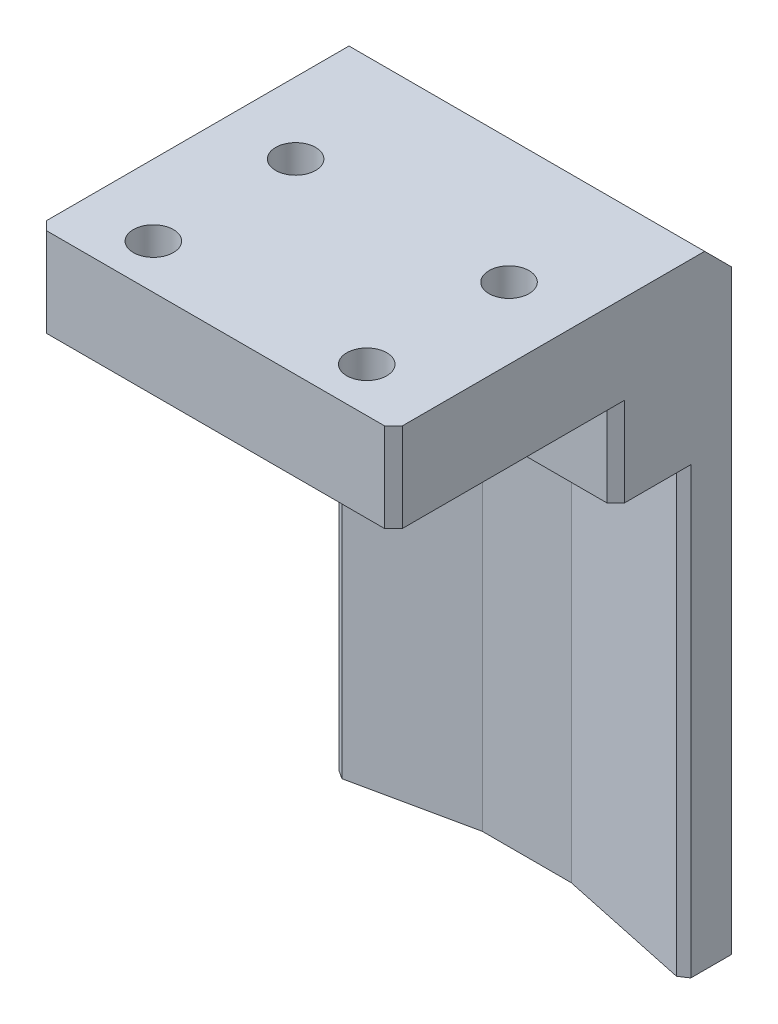
ISO-10303-21;
HEADER;
FILE_DESCRIPTION(('STEP AP214'),'2;1');
FILE_NAME('part.step','',(''),(''),'','','');
FILE_SCHEMA(('AUTOMOTIVE_DESIGN { 1 0 10303 214 1 1 1 1 }'));
ENDSEC;
DATA;
#1=APPLICATION_CONTEXT('core data for automotive mechanical design processes');
#2=APPLICATION_PROTOCOL_DEFINITION('international standard','automotive_design',2000,#1);
#3=PRODUCT_CONTEXT('',#1,'mechanical');
#4=PRODUCT('Part','Part','',(#3));
#5=PRODUCT_RELATED_PRODUCT_CATEGORY('part','',(#4));
#6=PRODUCT_DEFINITION_FORMATION('','',#4);
#7=PRODUCT_DEFINITION_CONTEXT('part definition',#1,'design');
#8=PRODUCT_DEFINITION('design','',#6,#7);
#9=PRODUCT_DEFINITION_SHAPE('','',#8);
#10=(LENGTH_UNIT() NAMED_UNIT(*) SI_UNIT(.MILLI.,.METRE.));
#11=(NAMED_UNIT(*) PLANE_ANGLE_UNIT() SI_UNIT($,.RADIAN.));
#12=(NAMED_UNIT(*) SI_UNIT($,.STERADIAN.) SOLID_ANGLE_UNIT());
#13=UNCERTAINTY_MEASURE_WITH_UNIT(LENGTH_MEASURE(1.E-05),#10,'distance_accuracy_value','');
#14=(GEOMETRIC_REPRESENTATION_CONTEXT(3) GLOBAL_UNCERTAINTY_ASSIGNED_CONTEXT((#13)) GLOBAL_UNIT_ASSIGNED_CONTEXT((#10,
#11,#12)) REPRESENTATION_CONTEXT('',''));
#15=CARTESIAN_POINT('',(0.,0.,0.));
#16=DIRECTION('',(0.,0.,1.));
#17=DIRECTION('',(1.,0.,0.));
#18=AXIS2_PLACEMENT_3D('',#15,#16,#17);
#19=CARTESIAN_POINT('',(-20.,60.,7.5));
#20=DIRECTION('',(0.,0.,-1.));
#21=DIRECTION('',(-1.,0.,0.));
#22=AXIS2_PLACEMENT_3D('',#19,#20,#21);
#23=PLANE('',#22);
#24=DIRECTION('',(1.,0.,0.));
#25=VECTOR('',#24,1.);
#26=CARTESIAN_POINT('',(-20.,60.,7.5));
#27=LINE('',#26,#25);
#28=CARTESIAN_POINT('',(-19.,60.,7.5));
#29=VERTEX_POINT('',#28);
#30=CARTESIAN_POINT('',(-12.,60.,7.5));
#31=VERTEX_POINT('',#30);
#32=EDGE_CURVE('E334',#29,#31,#27,.T.);
#33=ORIENTED_EDGE('',*,*,#32,.F.);
#34=DIRECTION('',(0.,-1.,0.));
#35=VECTOR('',#34,1.);
#36=CARTESIAN_POINT('',(-19.,60.,7.5));
#37=LINE('',#36,#35);
#38=CARTESIAN_POINT('',(-19.,50.,7.5));
#39=VERTEX_POINT('',#38);
#40=EDGE_CURVE('E429',#29,#39,#37,.T.);
#41=ORIENTED_EDGE('',*,*,#40,.T.);
#42=DIRECTION('',(1.,0.,0.));
#43=VECTOR('',#42,1.);
#44=CARTESIAN_POINT('',(-20.,50.,7.5));
#45=LINE('',#44,#43);
#46=CARTESIAN_POINT('',(-9.99999999999995,50.,7.5));
#47=VERTEX_POINT('',#46);
#48=EDGE_CURVE('E380',#39,#47,#45,.T.);
#49=ORIENTED_EDGE('',*,*,#48,.T.);
#50=DIRECTION('',(0.,-1.,0.));
#51=VECTOR('',#50,1.);
#52=CARTESIAN_POINT('',(-9.99999999999995,80.6155281280883,7.5));
#53=LINE('',#52,#51);
#54=CARTESIAN_POINT('',(-9.99999999999995,60.,7.5));
#55=VERTEX_POINT('',#54);
#56=EDGE_CURVE('E235',#55,#47,#53,.T.);
#57=ORIENTED_EDGE('',*,*,#56,.F.);
#58=EDGE_CURVE('E222',#31,#55,#27,.T.);
#59=ORIENTED_EDGE('',*,*,#58,.F.);
#60=EDGE_LOOP('',(#33,#41,#49,#57,#59));
#61=FACE_BOUND('',#60,.T.);
#62=ADVANCED_FACE('F34',(#61),#23,.F.);
#63=CARTESIAN_POINT('',(0.,60.,0.));
#64=DIRECTION('',(0.,1.,0.));
#65=DIRECTION('',(0.,0.,1.));
#66=AXIS2_PLACEMENT_3D('',#63,#64,#65);
#67=PLANE('',#66);
#68=CARTESIAN_POINT('',(12.,60.,27.5));
#69=DIRECTION('',(0.,-1.,0.));
#70=DIRECTION('',(0.,0.,-1.));
#71=AXIS2_PLACEMENT_3D('',#68,#69,#70);
#72=CIRCLE('',#71,4.);
#73=CARTESIAN_POINT('',(12.,60.,23.5));
#74=VERTEX_POINT('',#73);
#75=EDGE_CURVE('E297',#74,#74,#72,.T.);
#76=ORIENTED_EDGE('',*,*,#75,.F.);
#77=EDGE_LOOP('',(#76));
#78=FACE_BOUND('',#77,.T.);
#79=CARTESIAN_POINT('',(-12.,60.,27.5));
#80=DIRECTION('',(0.,-1.,0.));
#81=DIRECTION('',(0.,0.,-1.));
#82=AXIS2_PLACEMENT_3D('',#79,#80,#81);
#83=CIRCLE('',#82,4.);
#84=CARTESIAN_POINT('',(-12.,60.,23.5));
#85=VERTEX_POINT('',#84);
#86=EDGE_CURVE('E285',#85,#85,#83,.T.);
#87=ORIENTED_EDGE('',*,*,#86,.F.);
#88=EDGE_LOOP('',(#87));
#89=FACE_BOUND('',#88,.T.);
#90=DIRECTION('',(1.,0.,0.));
#91=VECTOR('',#90,1.);
#92=CARTESIAN_POINT('',(-20.,60.,32.5));
#93=LINE('',#92,#91);
#94=CARTESIAN_POINT('',(-19.,60.,32.5));
#95=VERTEX_POINT('',#94);
#96=CARTESIAN_POINT('',(19.,60.,32.5));
#97=VERTEX_POINT('',#96);
#98=EDGE_CURVE('E322',#95,#97,#93,.T.);
#99=ORIENTED_EDGE('',*,*,#98,.F.);
#100=DIRECTION('',(0.707106781186548,0.,0.707106781186548));
#101=VECTOR('',#100,1.);
#102=CARTESIAN_POINT('',(-19.,60.,32.5));
#103=LINE('',#102,#101);
#104=CARTESIAN_POINT('',(-20.,60.,31.5));
#105=VERTEX_POINT('',#104);
#106=EDGE_CURVE('E409',#95,#105,#103,.F.);
#107=ORIENTED_EDGE('',*,*,#106,.T.);
#108=DIRECTION('',(0.,0.,1.));
#109=VECTOR('',#108,1.);
#110=CARTESIAN_POINT('',(-20.,60.,-7.5));
#111=LINE('',#110,#109);
#112=CARTESIAN_POINT('',(-20.,60.,6.49999999999998));
#113=VERTEX_POINT('',#112);
#114=EDGE_CURVE('E309',#113,#105,#111,.T.);
#115=ORIENTED_EDGE('',*,*,#114,.F.);
#116=DIRECTION('',(-0.707106781186548,0.,-0.707106781186548));
#117=VECTOR('',#116,1.);
#118=CARTESIAN_POINT('',(-13.25,60.,13.25));
#119=LINE('',#118,#117);
#120=EDGE_CURVE('E42',#113,#29,#119,.F.);
#121=ORIENTED_EDGE('',*,*,#120,.T.);
#122=ORIENTED_EDGE('',*,*,#32,.T.);
#123=CARTESIAN_POINT('',(-12.,60.,11.5));
#124=DIRECTION('',(0.,-1.,0.));
#125=DIRECTION('',(0.,0.,-1.));
#126=AXIS2_PLACEMENT_3D('',#123,#124,#125);
#127=CIRCLE('',#126,4.);
#128=EDGE_CURVE('E261',#31,#31,#127,.T.);
#129=ORIENTED_EDGE('',*,*,#128,.F.);
#130=ORIENTED_EDGE('',*,*,#58,.T.);
#131=DIRECTION('',(0.707106781186544,0.,-0.707106781186551));
#132=VECTOR('',#131,1.);
#133=CARTESIAN_POINT('',(-9.99999999999995,60.,7.5));
#134=LINE('',#133,#132);
#135=CARTESIAN_POINT('',(-5.,60.,2.5));
#136=VERTEX_POINT('',#135);
#137=EDGE_CURVE('E211',#55,#136,#134,.T.);
#138=ORIENTED_EDGE('',*,*,#137,.T.);
#139=DIRECTION('',(1.,0.,0.));
#140=VECTOR('',#139,1.);
#141=CARTESIAN_POINT('',(-5.,60.,2.5));
#142=LINE('',#141,#140);
#143=CARTESIAN_POINT('',(5.,60.,2.5));
#144=VERTEX_POINT('',#143);
#145=EDGE_CURVE('E197',#136,#144,#142,.T.);
#146=ORIENTED_EDGE('',*,*,#145,.T.);
#147=DIRECTION('',(0.707106781186551,0.,0.707106781186544));
#148=VECTOR('',#147,1.);
#149=CARTESIAN_POINT('',(5.,60.,2.5));
#150=LINE('',#149,#148);
#151=CARTESIAN_POINT('',(10.0000000000001,60.,7.5));
#152=VERTEX_POINT('',#151);
#153=EDGE_CURVE('E230',#144,#152,#150,.T.);
#154=ORIENTED_EDGE('',*,*,#153,.T.);
#155=CARTESIAN_POINT('',(12.,60.,7.5));
#156=VERTEX_POINT('',#155);
#157=EDGE_CURVE('E344',#152,#156,#27,.T.);
#158=ORIENTED_EDGE('',*,*,#157,.T.);
#159=CARTESIAN_POINT('',(12.,60.,11.5));
#160=DIRECTION('',(0.,-1.,0.));
#161=DIRECTION('',(0.,0.,-1.));
#162=AXIS2_PLACEMENT_3D('',#159,#160,#161);
#163=CIRCLE('',#162,4.);
#164=EDGE_CURVE('E271',#156,#156,#163,.T.);
#165=ORIENTED_EDGE('',*,*,#164,.F.);
#166=CARTESIAN_POINT('',(19.,60.,7.5));
#167=VERTEX_POINT('',#166);
#168=EDGE_CURVE('E340',#156,#167,#27,.T.);
#169=ORIENTED_EDGE('',*,*,#168,.T.);
#170=DIRECTION('',(-0.707106781186554,0.,0.707106781186541));
#171=VECTOR('',#170,1.);
#172=CARTESIAN_POINT('',(13.2499999999998,60.,13.2500000000001));
#173=LINE('',#172,#171);
#174=CARTESIAN_POINT('',(20.,60.,6.5));
#175=VERTEX_POINT('',#174);
#176=EDGE_CURVE('E11',#167,#175,#173,.F.);
#177=ORIENTED_EDGE('',*,*,#176,.T.);
#178=DIRECTION('',(0.,0.,-1.));
#179=VECTOR('',#178,1.);
#180=CARTESIAN_POINT('',(20.,60.,-7.5));
#181=LINE('',#180,#179);
#182=CARTESIAN_POINT('',(20.,60.,31.5));
#183=VERTEX_POINT('',#182);
#184=EDGE_CURVE('E314',#183,#175,#181,.T.);
#185=ORIENTED_EDGE('',*,*,#184,.F.);
#186=DIRECTION('',(0.707106781186555,0.,-0.70710678118654));
#187=VECTOR('',#186,1.);
#188=CARTESIAN_POINT('',(20.,60.,31.5));
#189=LINE('',#188,#187);
#190=EDGE_CURVE('E404',#183,#97,#189,.F.);
#191=ORIENTED_EDGE('',*,*,#190,.T.);
#192=EDGE_LOOP('',(#99,#107,#115,#121,#122,#129,#130,#138,#146,#154,#158,#165,#169,#177,#185,#191));
#193=FACE_BOUND('',#192,.T.);
#194=ADVANCED_FACE('F219',(#78,#89,#193),#67,.F.);
#195=CARTESIAN_POINT('',(20.,60.,-7.5));
#196=DIRECTION('',(-1.,0.,0.));
#197=DIRECTION('',(0.,0.,1.));
#198=AXIS2_PLACEMENT_3D('',#195,#196,#197);
#199=PLANE('',#198);
#200=DIRECTION('',(0.,0.,-1.));
#201=VECTOR('',#200,1.);
#202=CARTESIAN_POINT('',(20.,70.,-7.5));
#203=LINE('',#202,#201);
#204=CARTESIAN_POINT('',(20.,70.,31.5));
#205=VERTEX_POINT('',#204);
#206=CARTESIAN_POINT('',(20.,70.,-2.50000000000001));
#207=VERTEX_POINT('',#206);
#208=EDGE_CURVE('E317',#205,#207,#203,.T.);
#209=ORIENTED_EDGE('',*,*,#208,.F.);
#210=DIRECTION('',(0.,-1.,0.));
#211=VECTOR('',#210,1.);
#212=CARTESIAN_POINT('',(20.,60.,31.5));
#213=LINE('',#212,#211);
#214=EDGE_CURVE('E426',#205,#183,#213,.T.);
#215=ORIENTED_EDGE('',*,*,#214,.T.);
#216=ORIENTED_EDGE('',*,*,#184,.T.);
#217=DIRECTION('',(0.,-1.,0.));
#218=VECTOR('',#217,1.);
#219=CARTESIAN_POINT('',(20.,60.,6.5));
#220=LINE('',#219,#218);
#221=CARTESIAN_POINT('',(20.,50.,6.5));
#222=VERTEX_POINT('',#221);
#223=EDGE_CURVE('E423',#175,#222,#220,.T.);
#224=ORIENTED_EDGE('',*,*,#223,.T.);
#225=DIRECTION('',(0.,0.,-1.));
#226=VECTOR('',#225,1.);
#227=CARTESIAN_POINT('',(20.,50.,-7.5));
#228=LINE('',#227,#226);
#229=CARTESIAN_POINT('',(20.,50.,-0.942223183281844));
#230=VERTEX_POINT('',#229);
#231=EDGE_CURVE('E259',#222,#230,#228,.T.);
#232=ORIENTED_EDGE('',*,*,#231,.T.);
#233=DIRECTION('',(0.,-1.,0.));
#234=VECTOR('',#233,1.);
#235=CARTESIAN_POINT('',(20.,60.,-0.942223183281844));
#236=LINE('',#235,#234);
#237=CARTESIAN_POINT('',(20.,0.,-0.942223183281845));
#238=VERTEX_POINT('',#237);
#239=EDGE_CURVE('E391',#230,#238,#236,.T.);
#240=ORIENTED_EDGE('',*,*,#239,.T.);
#241=DIRECTION('',(0.,0.,-1.));
#242=VECTOR('',#241,1.);
#243=CARTESIAN_POINT('',(20.,0.,-7.5));
#244=LINE('',#243,#242);
#245=CARTESIAN_POINT('',(20.,0.,-5.5));
#246=VERTEX_POINT('',#245);
#247=EDGE_CURVE('E319',#238,#246,#244,.T.);
#248=ORIENTED_EDGE('',*,*,#247,.T.);
#249=DIRECTION('',(0.,1.,0.));
#250=VECTOR('',#249,1.);
#251=CARTESIAN_POINT('',(20.,60.,-5.5));
#252=LINE('',#251,#250);
#253=CARTESIAN_POINT('',(20.,67.,-5.5));
#254=VERTEX_POINT('',#253);
#255=EDGE_CURVE('E367',#246,#254,#252,.T.);
#256=ORIENTED_EDGE('',*,*,#255,.T.);
#257=DIRECTION('',(0.,0.707106781186549,0.707106781186547));
#258=VECTOR('',#257,1.);
#259=CARTESIAN_POINT('',(20.,70.,-2.50000000000001));
#260=LINE('',#259,#258);
#261=EDGE_CURVE('E354',#254,#207,#260,.T.);
#262=ORIENTED_EDGE('',*,*,#261,.T.);
#263=EDGE_LOOP('',(#209,#215,#216,#224,#232,#240,#248,#256,#262));
#264=FACE_BOUND('',#263,.T.);
#265=ADVANCED_FACE('F455',(#264),#199,.F.);
#266=CARTESIAN_POINT('',(-20.,60.,-7.5));
#267=DIRECTION('',(0.,0.,1.));
#268=DIRECTION('',(1.,0.,0.));
#269=AXIS2_PLACEMENT_3D('',#266,#267,#268);
#270=PLANE('',#269);
#271=DIRECTION('',(1.,0.,0.));
#272=VECTOR('',#271,1.);
#273=CARTESIAN_POINT('',(20.,65.,-7.5));
#274=LINE('',#273,#272);
#275=CARTESIAN_POINT('',(-18.,65.,-7.5));
#276=VERTEX_POINT('',#275);
#277=CARTESIAN_POINT('',(18.,65.,-7.5));
#278=VERTEX_POINT('',#277);
#279=EDGE_CURVE('E351',#276,#278,#274,.T.);
#280=ORIENTED_EDGE('',*,*,#279,.T.);
#281=DIRECTION('',(0.,-1.,0.));
#282=VECTOR('',#281,1.);
#283=CARTESIAN_POINT('',(18.,60.,-7.5));
#284=LINE('',#283,#282);
#285=CARTESIAN_POINT('',(18.,0.,-7.5));
#286=VERTEX_POINT('',#285);
#287=EDGE_CURVE('E359',#278,#286,#284,.T.);
#288=ORIENTED_EDGE('',*,*,#287,.T.);
#289=DIRECTION('',(-1.,0.,0.));
#290=VECTOR('',#289,1.);
#291=CARTESIAN_POINT('',(-20.,0.,-7.5));
#292=LINE('',#291,#290);
#293=CARTESIAN_POINT('',(-18.,0.,-7.5));
#294=VERTEX_POINT('',#293);
#295=EDGE_CURVE('E482',#286,#294,#292,.T.);
#296=ORIENTED_EDGE('',*,*,#295,.T.);
#297=DIRECTION('',(0.,1.,0.));
#298=VECTOR('',#297,1.);
#299=CARTESIAN_POINT('',(-18.,60.,-7.5));
#300=LINE('',#299,#298);
#301=EDGE_CURVE('E357',#294,#276,#300,.T.);
#302=ORIENTED_EDGE('',*,*,#301,.T.);
#303=EDGE_LOOP('',(#280,#288,#296,#302));
#304=FACE_BOUND('',#303,.T.);
#305=ADVANCED_FACE('F470',(#304),#270,.F.);
#306=CARTESIAN_POINT('',(-20.,60.,-7.5));
#307=DIRECTION('',(1.,0.,0.));
#308=DIRECTION('',(0.,0.,-1.));
#309=AXIS2_PLACEMENT_3D('',#306,#307,#308);
#310=PLANE('',#309);
#311=ORIENTED_EDGE('',*,*,#114,.T.);
#312=DIRECTION('',(0.,1.,0.));
#313=VECTOR('',#312,1.);
#314=CARTESIAN_POINT('',(-20.,60.,31.5));
#315=LINE('',#314,#313);
#316=CARTESIAN_POINT('',(-20.,70.,31.5));
#317=VERTEX_POINT('',#316);
#318=EDGE_CURVE('E417',#105,#317,#315,.T.);
#319=ORIENTED_EDGE('',*,*,#318,.T.);
#320=DIRECTION('',(0.,0.,1.));
#321=VECTOR('',#320,1.);
#322=CARTESIAN_POINT('',(-20.,70.,-7.5));
#323=LINE('',#322,#321);
#324=CARTESIAN_POINT('',(-20.,70.,-2.5));
#325=VERTEX_POINT('',#324);
#326=EDGE_CURVE('E310',#325,#317,#323,.T.);
#327=ORIENTED_EDGE('',*,*,#326,.F.);
#328=DIRECTION('',(0.,-0.707106781186549,-0.707106781186547));
#329=VECTOR('',#328,1.);
#330=CARTESIAN_POINT('',(-20.,70.,-2.5));
#331=LINE('',#330,#329);
#332=CARTESIAN_POINT('',(-20.,67.,-5.50000000000001));
#333=VERTEX_POINT('',#332);
#334=EDGE_CURVE('E348',#325,#333,#331,.T.);
#335=ORIENTED_EDGE('',*,*,#334,.T.);
#336=DIRECTION('',(0.,-1.,0.));
#337=VECTOR('',#336,1.);
#338=CARTESIAN_POINT('',(-20.,60.,-5.5));
#339=LINE('',#338,#337);
#340=CARTESIAN_POINT('',(-20.,0.,-5.5));
#341=VERTEX_POINT('',#340);
#342=EDGE_CURVE('E373',#333,#341,#339,.T.);
#343=ORIENTED_EDGE('',*,*,#342,.T.);
#344=DIRECTION('',(0.,0.,1.));
#345=VECTOR('',#344,1.);
#346=CARTESIAN_POINT('',(-20.,0.,-7.5));
#347=LINE('',#346,#345);
#348=CARTESIAN_POINT('',(-20.,0.,-1.36733630662202));
#349=VERTEX_POINT('',#348);
#350=EDGE_CURVE('E480',#341,#349,#347,.T.);
#351=ORIENTED_EDGE('',*,*,#350,.T.);
#352=DIRECTION('',(0.,1.,0.));
#353=VECTOR('',#352,1.);
#354=CARTESIAN_POINT('',(-20.,60.,-1.36733630662202));
#355=LINE('',#354,#353);
#356=CARTESIAN_POINT('',(-20.,50.,-1.36733630662202));
#357=VERTEX_POINT('',#356);
#358=EDGE_CURVE('E382',#349,#357,#355,.T.);
#359=ORIENTED_EDGE('',*,*,#358,.T.);
#360=DIRECTION('',(0.,0.,1.));
#361=VECTOR('',#360,1.);
#362=CARTESIAN_POINT('',(-20.,50.,-7.5));
#363=LINE('',#362,#361);
#364=CARTESIAN_POINT('',(-20.,50.,6.49999999999998));
#365=VERTEX_POINT('',#364);
#366=EDGE_CURVE('E255',#357,#365,#363,.T.);
#367=ORIENTED_EDGE('',*,*,#366,.T.);
#368=DIRECTION('',(0.,1.,0.));
#369=VECTOR('',#368,1.);
#370=CARTESIAN_POINT('',(-20.,60.,6.49999999999998));
#371=LINE('',#370,#369);
#372=EDGE_CURVE('E412',#365,#113,#371,.T.);
#373=ORIENTED_EDGE('',*,*,#372,.T.);
#374=EDGE_LOOP('',(#311,#319,#327,#335,#343,#351,#359,#367,#373));
#375=FACE_BOUND('',#374,.T.);
#376=ADVANCED_FACE('F462',(#375),#310,.F.);
#377=CARTESIAN_POINT('',(10.0000000000001,50.,7.5));
#378=VERTEX_POINT('',#377);
#379=CARTESIAN_POINT('',(19.,50.,7.5));
#380=VERTEX_POINT('',#379);
#381=EDGE_CURVE('E379',#378,#380,#45,.T.);
#382=ORIENTED_EDGE('',*,*,#381,.T.);
#383=DIRECTION('',(0.,1.,0.));
#384=VECTOR('',#383,1.);
#385=CARTESIAN_POINT('',(19.,60.,7.5));
#386=LINE('',#385,#384);
#387=EDGE_CURVE('E433',#380,#167,#386,.T.);
#388=ORIENTED_EDGE('',*,*,#387,.T.);
#389=ORIENTED_EDGE('',*,*,#168,.F.);
#390=ORIENTED_EDGE('',*,*,#157,.F.);
#391=DIRECTION('',(0.,-1.,0.));
#392=VECTOR('',#391,1.);
#393=CARTESIAN_POINT('',(10.0000000000001,80.6155281280883,7.5));
#394=LINE('',#393,#392);
#395=EDGE_CURVE('E231',#152,#378,#394,.T.);
#396=ORIENTED_EDGE('',*,*,#395,.T.);
#397=EDGE_LOOP('',(#382,#388,#389,#390,#396));
#398=FACE_BOUND('',#397,.T.);
#399=ADVANCED_FACE('F451',(#398),#23,.F.);
#400=CARTESIAN_POINT('',(0.,0.,0.));
#401=DIRECTION('',(0.,1.,0.));
#402=DIRECTION('',(0.,0.,1.));
#403=AXIS2_PLACEMENT_3D('',#400,#401,#402);
#404=PLANE('',#403);
#405=DIRECTION('',(-0.978147600733807,0.,0.207911690817752));
#406=VECTOR('',#405,1.);
#407=CARTESIAN_POINT('',(-0.971152752454807,0.,-4.56891448010192));
#408=LINE('',#407,#406);
#409=CARTESIAN_POINT('',(-6.,0.,-3.5));
#410=VERTEX_POINT('',#409);
#411=CARTESIAN_POINT('',(-19.0218523992662,0.,-0.732119827437547));
#412=VERTEX_POINT('',#411);
#413=EDGE_CURVE('E376',#410,#412,#408,.T.);
#414=ORIENTED_EDGE('',*,*,#413,.T.);
#415=DIRECTION('',(0.838670567945421,0.,0.544639035015032));
#416=VECTOR('',#415,1.);
#417=CARTESIAN_POINT('',(-20.,0.,-1.36733630662202));
#418=LINE('',#417,#416);
#419=EDGE_CURVE('E389',#412,#349,#418,.F.);
#420=ORIENTED_EDGE('',*,*,#419,.T.);
#421=ORIENTED_EDGE('',*,*,#350,.F.);
#422=DIRECTION('',(-0.707106781186548,0.,0.707106781186548));
#423=VECTOR('',#422,1.);
#424=CARTESIAN_POINT('',(-20.,0.,-5.5));
#425=LINE('',#424,#423);
#426=EDGE_CURVE('E362',#341,#294,#425,.F.);
#427=ORIENTED_EDGE('',*,*,#426,.T.);
#428=ORIENTED_EDGE('',*,*,#295,.F.);
#429=DIRECTION('',(-0.707106781186548,0.,-0.707106781186548));
#430=VECTOR('',#429,1.);
#431=CARTESIAN_POINT('',(18.,0.,-7.5));
#432=LINE('',#431,#430);
#433=EDGE_CURVE('E364',#286,#246,#432,.F.);
#434=ORIENTED_EDGE('',*,*,#433,.T.);
#435=ORIENTED_EDGE('',*,*,#247,.F.);
#436=DIRECTION('',(0.838670567945425,0.,-0.544639035015025));
#437=VECTOR('',#436,1.);
#438=CARTESIAN_POINT('',(20.,0.,-0.942223183281844));
#439=LINE('',#438,#437);
#440=CARTESIAN_POINT('',(19.0218523992662,0.,-0.307006704097394));
#441=VERTEX_POINT('',#440);
#442=EDGE_CURVE('E387',#238,#441,#439,.F.);
#443=ORIENTED_EDGE('',*,*,#442,.T.);
#444=DIRECTION('',(0.978147600733806,0.,0.20791169081776));
#445=VECTOR('',#444,1.);
#446=CARTESIAN_POINT('',(4.,0.,-3.5));
#447=LINE('',#446,#445);
#448=CARTESIAN_POINT('',(4.,0.,-3.5));
#449=VERTEX_POINT('',#448);
#450=EDGE_CURVE('E242',#449,#441,#447,.T.);
#451=ORIENTED_EDGE('',*,*,#450,.F.);
#452=DIRECTION('',(1.,0.,0.));
#453=VECTOR('',#452,1.);
#454=CARTESIAN_POINT('',(-6.,0.,-3.5));
#455=LINE('',#454,#453);
#456=EDGE_CURVE('E238',#410,#449,#455,.T.);
#457=ORIENTED_EDGE('',*,*,#456,.F.);
#458=EDGE_LOOP('',(#414,#420,#421,#427,#428,#434,#435,#443,#451,#457));
#459=FACE_BOUND('',#458,.T.);
#460=ADVANCED_FACE('F461',(#459),#404,.F.);
#461=CARTESIAN_POINT('',(-20.,70.,32.5));
#462=DIRECTION('',(0.,0.,-1.));
#463=DIRECTION('',(-1.,0.,0.));
#464=AXIS2_PLACEMENT_3D('',#461,#462,#463);
#465=PLANE('',#464);
#466=DIRECTION('',(1.,0.,0.));
#467=VECTOR('',#466,1.);
#468=CARTESIAN_POINT('',(-20.,70.,32.5));
#469=LINE('',#468,#467);
#470=CARTESIAN_POINT('',(-19.,70.,32.5));
#471=VERTEX_POINT('',#470);
#472=CARTESIAN_POINT('',(19.,70.,32.5));
#473=VERTEX_POINT('',#472);
#474=EDGE_CURVE('E313',#471,#473,#469,.T.);
#475=ORIENTED_EDGE('',*,*,#474,.F.);
#476=DIRECTION('',(0.,-1.,0.));
#477=VECTOR('',#476,1.);
#478=CARTESIAN_POINT('',(-19.,70.,32.5));
#479=LINE('',#478,#477);
#480=EDGE_CURVE('E402',#471,#95,#479,.T.);
#481=ORIENTED_EDGE('',*,*,#480,.T.);
#482=ORIENTED_EDGE('',*,*,#98,.T.);
#483=DIRECTION('',(0.,1.,0.));
#484=VECTOR('',#483,1.);
#485=CARTESIAN_POINT('',(19.,70.,32.5));
#486=LINE('',#485,#484);
#487=EDGE_CURVE('E400',#97,#473,#486,.T.);
#488=ORIENTED_EDGE('',*,*,#487,.T.);
#489=EDGE_LOOP('',(#475,#481,#482,#488));
#490=FACE_BOUND('',#489,.T.);
#491=ADVANCED_FACE('F468',(#490),#465,.F.);
#492=CARTESIAN_POINT('',(0.,70.,0.));
#493=DIRECTION('',(0.,1.,0.));
#494=DIRECTION('',(0.,0.,1.));
#495=AXIS2_PLACEMENT_3D('',#492,#493,#494);
#496=PLANE('',#495);
#497=CARTESIAN_POINT('',(-12.,70.,11.5));
#498=DIRECTION('',(0.,-1.,0.));
#499=DIRECTION('',(0.,0.,-1.));
#500=AXIS2_PLACEMENT_3D('',#497,#498,#499);
#501=CIRCLE('',#500,2.25);
#502=CARTESIAN_POINT('',(-12.,70.,9.25));
#503=VERTEX_POINT('',#502);
#504=EDGE_CURVE('E268',#503,#503,#501,.T.);
#505=ORIENTED_EDGE('',*,*,#504,.T.);
#506=EDGE_LOOP('',(#505));
#507=FACE_BOUND('',#506,.T.);
#508=CARTESIAN_POINT('',(12.,70.,11.5));
#509=DIRECTION('',(0.,-1.,0.));
#510=DIRECTION('',(0.,0.,-1.));
#511=AXIS2_PLACEMENT_3D('',#508,#509,#510);
#512=CIRCLE('',#511,2.25);
#513=CARTESIAN_POINT('',(12.,70.,9.25));
#514=VERTEX_POINT('',#513);
#515=EDGE_CURVE('E284',#514,#514,#512,.T.);
#516=ORIENTED_EDGE('',*,*,#515,.T.);
#517=EDGE_LOOP('',(#516));
#518=FACE_BOUND('',#517,.T.);
#519=CARTESIAN_POINT('',(-12.,70.,27.5));
#520=DIRECTION('',(0.,-1.,0.));
#521=DIRECTION('',(0.,0.,-1.));
#522=AXIS2_PLACEMENT_3D('',#519,#520,#521);
#523=CIRCLE('',#522,2.25);
#524=CARTESIAN_POINT('',(-12.,70.,25.25));
#525=VERTEX_POINT('',#524);
#526=EDGE_CURVE('E294',#525,#525,#523,.T.);
#527=ORIENTED_EDGE('',*,*,#526,.T.);
#528=EDGE_LOOP('',(#527));
#529=FACE_BOUND('',#528,.T.);
#530=CARTESIAN_POINT('',(12.,70.,27.5));
#531=DIRECTION('',(0.,-1.,0.));
#532=DIRECTION('',(0.,0.,-1.));
#533=AXIS2_PLACEMENT_3D('',#530,#531,#532);
#534=CIRCLE('',#533,2.25);
#535=CARTESIAN_POINT('',(12.,70.,25.25));
#536=VERTEX_POINT('',#535);
#537=EDGE_CURVE('E306',#536,#536,#534,.T.);
#538=ORIENTED_EDGE('',*,*,#537,.T.);
#539=EDGE_LOOP('',(#538));
#540=FACE_BOUND('',#539,.T.);
#541=ORIENTED_EDGE('',*,*,#326,.T.);
#542=DIRECTION('',(-0.707106781186548,0.,-0.707106781186548));
#543=VECTOR('',#542,1.);
#544=CARTESIAN_POINT('',(-25.75,70.,25.75));
#545=LINE('',#544,#543);
#546=EDGE_CURVE('E421',#317,#471,#545,.F.);
#547=ORIENTED_EDGE('',*,*,#546,.T.);
#548=ORIENTED_EDGE('',*,*,#474,.T.);
#549=DIRECTION('',(-0.707106781186555,0.,0.70710678118654));
#550=VECTOR('',#549,1.);
#551=CARTESIAN_POINT('',(25.7499999999998,70.,25.7500000000003));
#552=LINE('',#551,#550);
#553=EDGE_CURVE('E419',#473,#205,#552,.F.);
#554=ORIENTED_EDGE('',*,*,#553,.T.);
#555=ORIENTED_EDGE('',*,*,#208,.T.);
#556=DIRECTION('',(-1.,0.,0.));
#557=VECTOR('',#556,1.);
#558=CARTESIAN_POINT('',(-20.,70.,-2.50000000000001));
#559=LINE('',#558,#557);
#560=EDGE_CURVE('E345',#207,#325,#559,.T.);
#561=ORIENTED_EDGE('',*,*,#560,.T.);
#562=EDGE_LOOP('',(#541,#547,#548,#554,#555,#561));
#563=FACE_BOUND('',#562,.T.);
#564=ADVANCED_FACE('F511',(#507,#518,#529,#540,#563),#496,.T.);
#565=CARTESIAN_POINT('',(12.,60.,27.5));
#566=DIRECTION('',(0.,-1.,0.));
#567=DIRECTION('',(0.,0.,-1.));
#568=AXIS2_PLACEMENT_3D('',#565,#566,#567);
#569=CYLINDRICAL_SURFACE('',#568,2.25);
#570=ORIENTED_EDGE('',*,*,#537,.F.);
#571=EDGE_LOOP('',(#570));
#572=FACE_BOUND('',#571,.T.);
#573=CARTESIAN_POINT('',(12.,64.4,27.5));
#574=DIRECTION('',(0.,-1.,0.));
#575=DIRECTION('',(0.,0.,-1.));
#576=AXIS2_PLACEMENT_3D('',#573,#574,#575);
#577=CIRCLE('',#576,2.25);
#578=CARTESIAN_POINT('',(12.,64.4,25.25));
#579=VERTEX_POINT('',#578);
#580=EDGE_CURVE('E303',#579,#579,#577,.T.);
#581=ORIENTED_EDGE('',*,*,#580,.T.);
#582=EDGE_LOOP('',(#581));
#583=FACE_BOUND('',#582,.T.);
#584=ADVANCED_FACE('F590',(#572,#583),#569,.F.);
#585=CARTESIAN_POINT('',(14.25,64.4,27.5));
#586=DIRECTION('',(0.,1.,0.));
#587=DIRECTION('',(0.,0.,1.));
#588=AXIS2_PLACEMENT_3D('',#585,#586,#587);
#589=PLANE('',#588);
#590=ORIENTED_EDGE('',*,*,#580,.F.);
#591=EDGE_LOOP('',(#590));
#592=FACE_BOUND('',#591,.T.);
#593=CARTESIAN_POINT('',(12.,64.4,27.5));
#594=DIRECTION('',(0.,-1.,0.));
#595=DIRECTION('',(0.,0.,-1.));
#596=AXIS2_PLACEMENT_3D('',#593,#594,#595);
#597=CIRCLE('',#596,4.);
#598=CARTESIAN_POINT('',(12.,64.4,23.5));
#599=VERTEX_POINT('',#598);
#600=EDGE_CURVE('E300',#599,#599,#597,.T.);
#601=ORIENTED_EDGE('',*,*,#600,.T.);
#602=EDGE_LOOP('',(#601));
#603=FACE_BOUND('',#602,.T.);
#604=ADVANCED_FACE('F586',(#592,#603),#589,.F.);
#605=CARTESIAN_POINT('',(12.,60.,27.5));
#606=DIRECTION('',(0.,-1.,0.));
#607=DIRECTION('',(0.,0.,-1.));
#608=AXIS2_PLACEMENT_3D('',#605,#606,#607);
#609=CYLINDRICAL_SURFACE('',#608,4.);
#610=ORIENTED_EDGE('',*,*,#600,.F.);
#611=EDGE_LOOP('',(#610));
#612=FACE_BOUND('',#611,.T.);
#613=ORIENTED_EDGE('',*,*,#75,.T.);
#614=EDGE_LOOP('',(#613));
#615=FACE_BOUND('',#614,.T.);
#616=ADVANCED_FACE('F582',(#612,#615),#609,.F.);
#617=CARTESIAN_POINT('',(-12.,60.,27.5));
#618=DIRECTION('',(0.,-1.,0.));
#619=DIRECTION('',(0.,0.,-1.));
#620=AXIS2_PLACEMENT_3D('',#617,#618,#619);
#621=CYLINDRICAL_SURFACE('',#620,2.25);
#622=ORIENTED_EDGE('',*,*,#526,.F.);
#623=EDGE_LOOP('',(#622));
#624=FACE_BOUND('',#623,.T.);
#625=CARTESIAN_POINT('',(-12.,64.4,27.5));
#626=DIRECTION('',(0.,-1.,0.));
#627=DIRECTION('',(0.,0.,-1.));
#628=AXIS2_PLACEMENT_3D('',#625,#626,#627);
#629=CIRCLE('',#628,2.25);
#630=CARTESIAN_POINT('',(-12.,64.4,25.25));
#631=VERTEX_POINT('',#630);
#632=EDGE_CURVE('E291',#631,#631,#629,.T.);
#633=ORIENTED_EDGE('',*,*,#632,.T.);
#634=EDGE_LOOP('',(#633));
#635=FACE_BOUND('',#634,.T.);
#636=ADVANCED_FACE('F578',(#624,#635),#621,.F.);
#637=CARTESIAN_POINT('',(-9.75,64.4,27.5));
#638=DIRECTION('',(0.,1.,0.));
#639=DIRECTION('',(0.,0.,1.));
#640=AXIS2_PLACEMENT_3D('',#637,#638,#639);
#641=PLANE('',#640);
#642=ORIENTED_EDGE('',*,*,#632,.F.);
#643=EDGE_LOOP('',(#642));
#644=FACE_BOUND('',#643,.T.);
#645=CARTESIAN_POINT('',(-12.,64.4,27.5));
#646=DIRECTION('',(0.,-1.,0.));
#647=DIRECTION('',(0.,0.,-1.));
#648=AXIS2_PLACEMENT_3D('',#645,#646,#647);
#649=CIRCLE('',#648,4.);
#650=CARTESIAN_POINT('',(-12.,64.4,23.5));
#651=VERTEX_POINT('',#650);
#652=EDGE_CURVE('E288',#651,#651,#649,.T.);
#653=ORIENTED_EDGE('',*,*,#652,.T.);
#654=EDGE_LOOP('',(#653));
#655=FACE_BOUND('',#654,.T.);
#656=ADVANCED_FACE('F574',(#644,#655),#641,.F.);
#657=CARTESIAN_POINT('',(-12.,60.,27.5));
#658=DIRECTION('',(0.,-1.,0.));
#659=DIRECTION('',(0.,0.,-1.));
#660=AXIS2_PLACEMENT_3D('',#657,#658,#659);
#661=CYLINDRICAL_SURFACE('',#660,4.);
#662=ORIENTED_EDGE('',*,*,#652,.F.);
#663=EDGE_LOOP('',(#662));
#664=FACE_BOUND('',#663,.T.);
#665=ORIENTED_EDGE('',*,*,#86,.T.);
#666=EDGE_LOOP('',(#665));
#667=FACE_BOUND('',#666,.T.);
#668=ADVANCED_FACE('F570',(#664,#667),#661,.F.);
#669=CARTESIAN_POINT('',(12.,60.,11.5));
#670=DIRECTION('',(0.,-1.,0.));
#671=DIRECTION('',(0.,0.,-1.));
#672=AXIS2_PLACEMENT_3D('',#669,#670,#671);
#673=CYLINDRICAL_SURFACE('',#672,2.25);
#674=ORIENTED_EDGE('',*,*,#515,.F.);
#675=EDGE_LOOP('',(#674));
#676=FACE_BOUND('',#675,.T.);
#677=CARTESIAN_POINT('',(12.,64.4,11.5));
#678=DIRECTION('',(0.,-1.,0.));
#679=DIRECTION('',(0.,0.,-1.));
#680=AXIS2_PLACEMENT_3D('',#677,#678,#679);
#681=CIRCLE('',#680,2.25);
#682=CARTESIAN_POINT('',(12.,64.4,9.25));
#683=VERTEX_POINT('',#682);
#684=EDGE_CURVE('E874',#683,#683,#681,.T.);
#685=ORIENTED_EDGE('',*,*,#684,.T.);
#686=EDGE_LOOP('',(#685));
#687=FACE_BOUND('',#686,.T.);
#688=ADVANCED_FACE('F566',(#676,#687),#673,.F.);
#689=CARTESIAN_POINT('',(14.25,64.4,11.5));
#690=DIRECTION('',(0.,1.,0.));
#691=DIRECTION('',(0.,0.,1.));
#692=AXIS2_PLACEMENT_3D('',#689,#690,#691);
#693=PLANE('',#692);
#694=ORIENTED_EDGE('',*,*,#684,.F.);
#695=EDGE_LOOP('',(#694));
#696=FACE_BOUND('',#695,.T.);
#697=CARTESIAN_POINT('',(12.,64.4,11.5));
#698=DIRECTION('',(0.,-1.,0.));
#699=DIRECTION('',(0.,0.,-1.));
#700=AXIS2_PLACEMENT_3D('',#697,#698,#699);
#701=CIRCLE('',#700,4.);
#702=CARTESIAN_POINT('',(12.,64.4,7.5));
#703=VERTEX_POINT('',#702);
#704=EDGE_CURVE('E278',#703,#703,#701,.T.);
#705=ORIENTED_EDGE('',*,*,#704,.T.);
#706=EDGE_LOOP('',(#705));
#707=FACE_BOUND('',#706,.T.);
#708=ADVANCED_FACE('F562',(#696,#707),#693,.F.);
#709=CARTESIAN_POINT('',(12.,60.,11.5));
#710=DIRECTION('',(0.,-1.,0.));
#711=DIRECTION('',(0.,0.,-1.));
#712=AXIS2_PLACEMENT_3D('',#709,#710,#711);
#713=CYLINDRICAL_SURFACE('',#712,4.);
#714=ORIENTED_EDGE('',*,*,#704,.F.);
#715=EDGE_LOOP('',(#714));
#716=FACE_BOUND('',#715,.T.);
#717=ORIENTED_EDGE('',*,*,#164,.T.);
#718=EDGE_LOOP('',(#717));
#719=FACE_BOUND('',#718,.T.);
#720=ADVANCED_FACE('F558',(#716,#719),#713,.F.);
#721=CARTESIAN_POINT('',(-12.,60.,11.5));
#722=DIRECTION('',(0.,-1.,0.));
#723=DIRECTION('',(0.,0.,-1.));
#724=AXIS2_PLACEMENT_3D('',#721,#722,#723);
#725=CYLINDRICAL_SURFACE('',#724,2.25);
#726=ORIENTED_EDGE('',*,*,#504,.F.);
#727=EDGE_LOOP('',(#726));
#728=FACE_BOUND('',#727,.T.);
#729=CARTESIAN_POINT('',(-12.,64.4,11.5));
#730=DIRECTION('',(0.,-1.,0.));
#731=DIRECTION('',(0.,0.,-1.));
#732=AXIS2_PLACEMENT_3D('',#729,#730,#731);
#733=CIRCLE('',#732,2.25);
#734=CARTESIAN_POINT('',(-12.,64.4,9.25));
#735=VERTEX_POINT('',#734);
#736=EDGE_CURVE('E265',#735,#735,#733,.T.);
#737=ORIENTED_EDGE('',*,*,#736,.T.);
#738=EDGE_LOOP('',(#737));
#739=FACE_BOUND('',#738,.T.);
#740=ADVANCED_FACE('F554',(#728,#739),#725,.F.);
#741=CARTESIAN_POINT('',(-9.75,64.4,11.5));
#742=DIRECTION('',(0.,1.,0.));
#743=DIRECTION('',(0.,0.,1.));
#744=AXIS2_PLACEMENT_3D('',#741,#742,#743);
#745=PLANE('',#744);
#746=ORIENTED_EDGE('',*,*,#736,.F.);
#747=EDGE_LOOP('',(#746));
#748=FACE_BOUND('',#747,.T.);
#749=CARTESIAN_POINT('',(-12.,64.4,11.5));
#750=DIRECTION('',(0.,-1.,0.));
#751=DIRECTION('',(0.,0.,-1.));
#752=AXIS2_PLACEMENT_3D('',#749,#750,#751);
#753=CIRCLE('',#752,4.);
#754=CARTESIAN_POINT('',(-12.,64.4,7.5));
#755=VERTEX_POINT('',#754);
#756=EDGE_CURVE('E262',#755,#755,#753,.T.);
#757=ORIENTED_EDGE('',*,*,#756,.T.);
#758=EDGE_LOOP('',(#757));
#759=FACE_BOUND('',#758,.T.);
#760=ADVANCED_FACE('F550',(#748,#759),#745,.F.);
#761=CARTESIAN_POINT('',(-12.,60.,11.5));
#762=DIRECTION('',(0.,-1.,0.));
#763=DIRECTION('',(0.,0.,-1.));
#764=AXIS2_PLACEMENT_3D('',#761,#762,#763);
#765=CYLINDRICAL_SURFACE('',#764,4.);
#766=ORIENTED_EDGE('',*,*,#756,.F.);
#767=EDGE_LOOP('',(#766));
#768=FACE_BOUND('',#767,.T.);
#769=ORIENTED_EDGE('',*,*,#128,.T.);
#770=EDGE_LOOP('',(#769));
#771=FACE_BOUND('',#770,.T.);
#772=ADVANCED_FACE('F547',(#768,#771),#765,.F.);
#773=CARTESIAN_POINT('',(0.,70.,-2.50000000000001));
#774=DIRECTION('',(0.,0.707106781186546,-0.707106781186548));
#775=DIRECTION('',(1.,0.,0.));
#776=AXIS2_PLACEMENT_3D('',#773,#774,#775);
#777=PLANE('',#776);
#778=ORIENTED_EDGE('',*,*,#261,.F.);
#779=DIRECTION('',(0.577350269189625,0.577350269189627,0.577350269189625));
#780=VECTOR('',#779,1.);
#781=CARTESIAN_POINT('',(15.3333333333333,62.3333333333333,-10.1666666666667));
#782=LINE('',#781,#780);
#783=EDGE_CURVE('E371',#254,#278,#782,.F.);
#784=ORIENTED_EDGE('',*,*,#783,.T.);
#785=ORIENTED_EDGE('',*,*,#279,.F.);
#786=DIRECTION('',(0.577350269189625,-0.577350269189627,-0.577350269189625));
#787=VECTOR('',#786,1.);
#788=CARTESIAN_POINT('',(-15.3333333333333,62.3333333333333,-10.1666666666667));
#789=LINE('',#788,#787);
#790=EDGE_CURVE('E369',#276,#333,#789,.F.);
#791=ORIENTED_EDGE('',*,*,#790,.T.);
#792=ORIENTED_EDGE('',*,*,#334,.F.);
#793=ORIENTED_EDGE('',*,*,#560,.F.);
#794=EDGE_LOOP('',(#778,#784,#785,#791,#792,#793));
#795=FACE_BOUND('',#794,.T.);
#796=ADVANCED_FACE('F501',(#795),#777,.T.);
#797=CARTESIAN_POINT('',(18.,60.,-7.5));
#798=DIRECTION('',(-0.707106781186547,0.,0.707106781186547));
#799=DIRECTION('',(0.,-1.,0.));
#800=AXIS2_PLACEMENT_3D('',#797,#798,#799);
#801=PLANE('',#800);
#802=ORIENTED_EDGE('',*,*,#783,.F.);
#803=ORIENTED_EDGE('',*,*,#255,.F.);
#804=ORIENTED_EDGE('',*,*,#433,.F.);
#805=ORIENTED_EDGE('',*,*,#287,.F.);
#806=EDGE_LOOP('',(#802,#803,#804,#805));
#807=FACE_BOUND('',#806,.T.);
#808=ADVANCED_FACE('F498',(#807),#801,.F.);
#809=CARTESIAN_POINT('',(-20.,60.,-5.5));
#810=DIRECTION('',(0.707106781186547,0.,0.707106781186547));
#811=DIRECTION('',(0.,-1.,0.));
#812=AXIS2_PLACEMENT_3D('',#809,#810,#811);
#813=PLANE('',#812);
#814=ORIENTED_EDGE('',*,*,#790,.F.);
#815=ORIENTED_EDGE('',*,*,#301,.F.);
#816=ORIENTED_EDGE('',*,*,#426,.F.);
#817=ORIENTED_EDGE('',*,*,#342,.F.);
#818=EDGE_LOOP('',(#814,#815,#816,#817));
#819=FACE_BOUND('',#818,.T.);
#820=ADVANCED_FACE('F505',(#819),#813,.F.);
#821=CARTESIAN_POINT('',(0.,50.,0.));
#822=DIRECTION('',(0.,1.,0.));
#823=DIRECTION('',(0.,0.,1.));
#824=AXIS2_PLACEMENT_3D('',#821,#822,#823);
#825=PLANE('',#824);
#826=ORIENTED_EDGE('',*,*,#48,.F.);
#827=DIRECTION('',(0.707106781186548,0.,0.707106781186548));
#828=VECTOR('',#827,1.);
#829=CARTESIAN_POINT('',(-19.,50.,7.5));
#830=LINE('',#829,#828);
#831=EDGE_CURVE('E57',#39,#365,#830,.F.);
#832=ORIENTED_EDGE('',*,*,#831,.T.);
#833=ORIENTED_EDGE('',*,*,#366,.F.);
#834=DIRECTION('',(-0.838670567945421,0.,-0.544639035015032));
#835=VECTOR('',#834,1.);
#836=CARTESIAN_POINT('',(-5.30807163324993,50.,8.17371353345951));
#837=LINE('',#836,#835);
#838=CARTESIAN_POINT('',(-19.0218523992662,50.,-0.732119827437547));
#839=VERTEX_POINT('',#838);
#840=EDGE_CURVE('E396',#357,#839,#837,.F.);
#841=ORIENTED_EDGE('',*,*,#840,.T.);
#842=DIRECTION('',(0.978147600733807,0.,-0.207911690817752));
#843=VECTOR('',#842,1.);
#844=CARTESIAN_POINT('',(-6.,50.,-3.5));
#845=LINE('',#844,#843);
#846=CARTESIAN_POINT('',(-6.,50.,-3.5));
#847=VERTEX_POINT('',#846);
#848=EDGE_CURVE('E239',#839,#847,#845,.T.);
#849=ORIENTED_EDGE('',*,*,#848,.T.);
#850=DIRECTION('',(1.,0.,0.));
#851=VECTOR('',#850,1.);
#852=CARTESIAN_POINT('',(-6.,50.,-3.5));
#853=LINE('',#852,#851);
#854=CARTESIAN_POINT('',(4.,50.,-3.5));
#855=VERTEX_POINT('',#854);
#856=EDGE_CURVE('E241',#847,#855,#853,.T.);
#857=ORIENTED_EDGE('',*,*,#856,.T.);
#858=DIRECTION('',(0.978147600733806,0.,0.20791169081776));
#859=VECTOR('',#858,1.);
#860=CARTESIAN_POINT('',(4.,50.,-3.5));
#861=LINE('',#860,#859);
#862=CARTESIAN_POINT('',(19.0218523992662,50.,-0.307006704097394));
#863=VERTEX_POINT('',#862);
#864=EDGE_CURVE('E245',#855,#863,#861,.T.);
#865=ORIENTED_EDGE('',*,*,#864,.T.);
#866=DIRECTION('',(-0.838670567945425,0.,0.544639035015025));
#867=VECTOR('',#866,1.);
#868=CARTESIAN_POINT('',(5.50225171465561,50.,8.47272463748694));
#869=LINE('',#868,#867);
#870=EDGE_CURVE('E398',#863,#230,#869,.F.);
#871=ORIENTED_EDGE('',*,*,#870,.T.);
#872=ORIENTED_EDGE('',*,*,#231,.F.);
#873=DIRECTION('',(0.707106781186554,0.,-0.707106781186541));
#874=VECTOR('',#873,1.);
#875=CARTESIAN_POINT('',(20.,50.,6.5));
#876=LINE('',#875,#874);
#877=EDGE_CURVE('E49',#222,#380,#876,.F.);
#878=ORIENTED_EDGE('',*,*,#877,.T.);
#879=ORIENTED_EDGE('',*,*,#381,.F.);
#880=DIRECTION('',(0.707106781186551,0.,0.707106781186544));
#881=VECTOR('',#880,1.);
#882=CARTESIAN_POINT('',(5.,50.,2.5));
#883=LINE('',#882,#881);
#884=CARTESIAN_POINT('',(5.,50.,2.5));
#885=VERTEX_POINT('',#884);
#886=EDGE_CURVE('E223',#885,#378,#883,.T.);
#887=ORIENTED_EDGE('',*,*,#886,.F.);
#888=DIRECTION('',(1.,0.,0.));
#889=VECTOR('',#888,1.);
#890=CARTESIAN_POINT('',(-5.,50.,2.5));
#891=LINE('',#890,#889);
#892=CARTESIAN_POINT('',(-5.,50.,2.5));
#893=VERTEX_POINT('',#892);
#894=EDGE_CURVE('E225',#893,#885,#891,.T.);
#895=ORIENTED_EDGE('',*,*,#894,.F.);
#896=DIRECTION('',(0.707106781186544,0.,-0.707106781186551));
#897=VECTOR('',#896,1.);
#898=CARTESIAN_POINT('',(-9.99999999999995,50.,7.5));
#899=LINE('',#898,#897);
#900=EDGE_CURVE('E214',#47,#893,#899,.T.);
#901=ORIENTED_EDGE('',*,*,#900,.F.);
#902=EDGE_LOOP('',(#826,#832,#833,#841,#849,#857,#865,#871,#872,#878,#879,#887,#895,#901));
#903=FACE_BOUND('',#902,.T.);
#904=ADVANCED_FACE('F514',(#903),#825,.F.);
#905=CARTESIAN_POINT('',(-6.,50.,-3.5));
#906=DIRECTION('',(-0.207911690817752,0.,-0.978147600733807));
#907=DIRECTION('',(-0.978147600733807,0.,0.207911690817752));
#908=AXIS2_PLACEMENT_3D('',#905,#906,#907);
#909=PLANE('',#908);
#910=ORIENTED_EDGE('',*,*,#848,.F.);
#911=DIRECTION('',(0.,-1.,0.));
#912=VECTOR('',#911,1.);
#913=CARTESIAN_POINT('',(-19.0218523992662,50.,-0.732119827437548));
#914=LINE('',#913,#912);
#915=EDGE_CURVE('E385',#839,#412,#914,.T.);
#916=ORIENTED_EDGE('',*,*,#915,.T.);
#917=ORIENTED_EDGE('',*,*,#413,.F.);
#918=DIRECTION('',(0.,-1.,0.));
#919=VECTOR('',#918,1.);
#920=CARTESIAN_POINT('',(-6.,50.,-3.5));
#921=LINE('',#920,#919);
#922=EDGE_CURVE('E248',#847,#410,#921,.T.);
#923=ORIENTED_EDGE('',*,*,#922,.F.);
#924=EDGE_LOOP('',(#910,#916,#917,#923));
#925=FACE_BOUND('',#924,.T.);
#926=ADVANCED_FACE('F522',(#925),#909,.F.);
#927=CARTESIAN_POINT('',(4.,50.,-3.5));
#928=DIRECTION('',(0.20791169081776,0.,-0.978147600733805));
#929=DIRECTION('',(-0.978147600733806,0.,-0.20791169081776));
#930=AXIS2_PLACEMENT_3D('',#927,#928,#929);
#931=PLANE('',#930);
#932=ORIENTED_EDGE('',*,*,#450,.T.);
#933=DIRECTION('',(0.,1.,0.));
#934=VECTOR('',#933,1.);
#935=CARTESIAN_POINT('',(19.0218523992662,50.,-0.307006704097395));
#936=LINE('',#935,#934);
#937=EDGE_CURVE('E394',#441,#863,#936,.T.);
#938=ORIENTED_EDGE('',*,*,#937,.T.);
#939=ORIENTED_EDGE('',*,*,#864,.F.);
#940=DIRECTION('',(0.,-1.,0.));
#941=VECTOR('',#940,1.);
#942=CARTESIAN_POINT('',(4.,50.,-3.5));
#943=LINE('',#942,#941);
#944=EDGE_CURVE('E253',#855,#449,#943,.T.);
#945=ORIENTED_EDGE('',*,*,#944,.T.);
#946=EDGE_LOOP('',(#932,#938,#939,#945));
#947=FACE_BOUND('',#946,.T.);
#948=ADVANCED_FACE('F535',(#947),#931,.F.);
#949=CARTESIAN_POINT('',(-6.,50.,-3.5));
#950=DIRECTION('',(0.,0.,-1.));
#951=DIRECTION('',(-1.,0.,0.));
#952=AXIS2_PLACEMENT_3D('',#949,#950,#951);
#953=PLANE('',#952);
#954=ORIENTED_EDGE('',*,*,#456,.T.);
#955=ORIENTED_EDGE('',*,*,#944,.F.);
#956=ORIENTED_EDGE('',*,*,#856,.F.);
#957=ORIENTED_EDGE('',*,*,#922,.T.);
#958=EDGE_LOOP('',(#954,#955,#956,#957));
#959=FACE_BOUND('',#958,.T.);
#960=ADVANCED_FACE('F527',(#959),#953,.F.);
#961=CARTESIAN_POINT('',(-20.,60.,-1.36733630662202));
#962=DIRECTION('',(0.544639035015032,0.,-0.838670567945421));
#963=DIRECTION('',(0.,1.,0.));
#964=AXIS2_PLACEMENT_3D('',#961,#962,#963);
#965=PLANE('',#964);
#966=ORIENTED_EDGE('',*,*,#419,.F.);
#967=ORIENTED_EDGE('',*,*,#915,.F.);
#968=ORIENTED_EDGE('',*,*,#840,.F.);
#969=ORIENTED_EDGE('',*,*,#358,.F.);
#970=EDGE_LOOP('',(#966,#967,#968,#969));
#971=FACE_BOUND('',#970,.T.);
#972=ADVANCED_FACE('F519',(#971),#965,.F.);
#973=CARTESIAN_POINT('',(20.,60.,-0.942223183281844));
#974=DIRECTION('',(-0.544639035015025,0.,-0.838670567945425));
#975=DIRECTION('',(0.,-1.,0.));
#976=AXIS2_PLACEMENT_3D('',#973,#974,#975);
#977=PLANE('',#976);
#978=ORIENTED_EDGE('',*,*,#870,.F.);
#979=ORIENTED_EDGE('',*,*,#937,.F.);
#980=ORIENTED_EDGE('',*,*,#442,.F.);
#981=ORIENTED_EDGE('',*,*,#239,.F.);
#982=EDGE_LOOP('',(#978,#979,#980,#981));
#983=FACE_BOUND('',#982,.T.);
#984=ADVANCED_FACE('F534',(#983),#977,.F.);
#985=CARTESIAN_POINT('',(-9.99999999999995,80.6155281280883,7.5));
#986=DIRECTION('',(-0.707106781186551,0.,-0.707106781186544));
#987=DIRECTION('',(-0.707106781186544,0.,0.707106781186551));
#988=AXIS2_PLACEMENT_3D('',#985,#986,#987);
#989=PLANE('',#988);
#990=ORIENTED_EDGE('',*,*,#56,.T.);
#991=ORIENTED_EDGE('',*,*,#900,.T.);
#992=DIRECTION('',(0.,-1.,0.));
#993=VECTOR('',#992,1.);
#994=CARTESIAN_POINT('',(-5.,80.6155281280883,2.5));
#995=LINE('',#994,#993);
#996=EDGE_CURVE('E200',#136,#893,#995,.T.);
#997=ORIENTED_EDGE('',*,*,#996,.F.);
#998=ORIENTED_EDGE('',*,*,#137,.F.);
#999=EDGE_LOOP('',(#990,#991,#997,#998));
#1000=FACE_BOUND('',#999,.T.);
#1001=ADVANCED_FACE('F210',(#1000),#989,.F.);
#1002=CARTESIAN_POINT('',(-5.,80.6155281280883,2.5));
#1003=DIRECTION('',(0.,0.,-1.));
#1004=DIRECTION('',(-1.,0.,0.));
#1005=AXIS2_PLACEMENT_3D('',#1002,#1003,#1004);
#1006=PLANE('',#1005);
#1007=ORIENTED_EDGE('',*,*,#996,.T.);
#1008=ORIENTED_EDGE('',*,*,#894,.T.);
#1009=DIRECTION('',(0.,-1.,0.));
#1010=VECTOR('',#1009,1.);
#1011=CARTESIAN_POINT('',(5.,80.6155281280883,2.5));
#1012=LINE('',#1011,#1010);
#1013=EDGE_CURVE('E203',#144,#885,#1012,.T.);
#1014=ORIENTED_EDGE('',*,*,#1013,.F.);
#1015=ORIENTED_EDGE('',*,*,#145,.F.);
#1016=EDGE_LOOP('',(#1007,#1008,#1014,#1015));
#1017=FACE_BOUND('',#1016,.T.);
#1018=ADVANCED_FACE('F199',(#1017),#1006,.F.);
#1019=CARTESIAN_POINT('',(5.,80.6155281280883,2.5));
#1020=DIRECTION('',(0.707106781186544,0.,-0.707106781186551));
#1021=DIRECTION('',(-0.707106781186551,0.,-0.707106781186544));
#1022=AXIS2_PLACEMENT_3D('',#1019,#1020,#1021);
#1023=PLANE('',#1022);
#1024=ORIENTED_EDGE('',*,*,#1013,.T.);
#1025=ORIENTED_EDGE('',*,*,#886,.T.);
#1026=ORIENTED_EDGE('',*,*,#395,.F.);
#1027=ORIENTED_EDGE('',*,*,#153,.F.);
#1028=EDGE_LOOP('',(#1024,#1025,#1026,#1027));
#1029=FACE_BOUND('',#1028,.T.);
#1030=ADVANCED_FACE('F729',(#1029),#1023,.F.);
#1031=CARTESIAN_POINT('',(-19.,70.,32.5));
#1032=DIRECTION('',(0.707106781186547,0.,-0.707106781186547));
#1033=DIRECTION('',(0.,-1.,0.));
#1034=AXIS2_PLACEMENT_3D('',#1031,#1032,#1033);
#1035=PLANE('',#1034);
#1036=ORIENTED_EDGE('',*,*,#546,.F.);
#1037=ORIENTED_EDGE('',*,*,#318,.F.);
#1038=ORIENTED_EDGE('',*,*,#106,.F.);
#1039=ORIENTED_EDGE('',*,*,#480,.F.);
#1040=EDGE_LOOP('',(#1036,#1037,#1038,#1039));
#1041=FACE_BOUND('',#1040,.T.);
#1042=ADVANCED_FACE('F446',(#1041),#1035,.F.);
#1043=CARTESIAN_POINT('',(20.,60.,31.5));
#1044=DIRECTION('',(-0.70710678118654,0.,-0.707106781186555));
#1045=DIRECTION('',(0.,-1.,0.));
#1046=AXIS2_PLACEMENT_3D('',#1043,#1044,#1045);
#1047=PLANE('',#1046);
#1048=ORIENTED_EDGE('',*,*,#553,.F.);
#1049=ORIENTED_EDGE('',*,*,#487,.F.);
#1050=ORIENTED_EDGE('',*,*,#190,.F.);
#1051=ORIENTED_EDGE('',*,*,#214,.F.);
#1052=EDGE_LOOP('',(#1048,#1049,#1050,#1051));
#1053=FACE_BOUND('',#1052,.T.);
#1054=ADVANCED_FACE('F440',(#1053),#1047,.F.);
#1055=CARTESIAN_POINT('',(-19.,60.,7.5));
#1056=DIRECTION('',(0.707106781186547,0.,-0.707106781186547));
#1057=DIRECTION('',(0.,-1.,0.));
#1058=AXIS2_PLACEMENT_3D('',#1055,#1056,#1057);
#1059=PLANE('',#1058);
#1060=ORIENTED_EDGE('',*,*,#120,.F.);
#1061=ORIENTED_EDGE('',*,*,#372,.F.);
#1062=ORIENTED_EDGE('',*,*,#831,.F.);
#1063=ORIENTED_EDGE('',*,*,#40,.F.);
#1064=EDGE_LOOP('',(#1060,#1061,#1062,#1063));
#1065=FACE_BOUND('',#1064,.T.);
#1066=ADVANCED_FACE('F438',(#1065),#1059,.F.);
#1067=CARTESIAN_POINT('',(20.,60.,6.5));
#1068=DIRECTION('',(-0.707106781186541,0.,-0.707106781186554));
#1069=DIRECTION('',(0.,-1.,0.));
#1070=AXIS2_PLACEMENT_3D('',#1067,#1068,#1069);
#1071=PLANE('',#1070);
#1072=ORIENTED_EDGE('',*,*,#176,.F.);
#1073=ORIENTED_EDGE('',*,*,#387,.F.);
#1074=ORIENTED_EDGE('',*,*,#877,.F.);
#1075=ORIENTED_EDGE('',*,*,#223,.F.);
#1076=EDGE_LOOP('',(#1072,#1073,#1074,#1075));
#1077=FACE_BOUND('',#1076,.T.);
#1078=ADVANCED_FACE('F36',(#1077),#1071,.F.);
#1079=CLOSED_SHELL('',(#62,#194,#265,#305,#376,#399,#460,#491,#564,#584,#604,#616,#636,#656,
#668,#688,#708,#720,#740,#760,#772,#796,#808,#820,#904,#926,#948,#960,#972,#984,#1001,#1018,
#1030,#1042,#1054,#1066,#1078));
#1080=MANIFOLD_SOLID_BREP('B2',#1079);
#1081=ADVANCED_BREP_SHAPE_REPRESENTATION('',(#18,#1080),#14);
#1082=SHAPE_DEFINITION_REPRESENTATION(#9,#1081);
ENDSEC;
END-ISO-10303-21;
